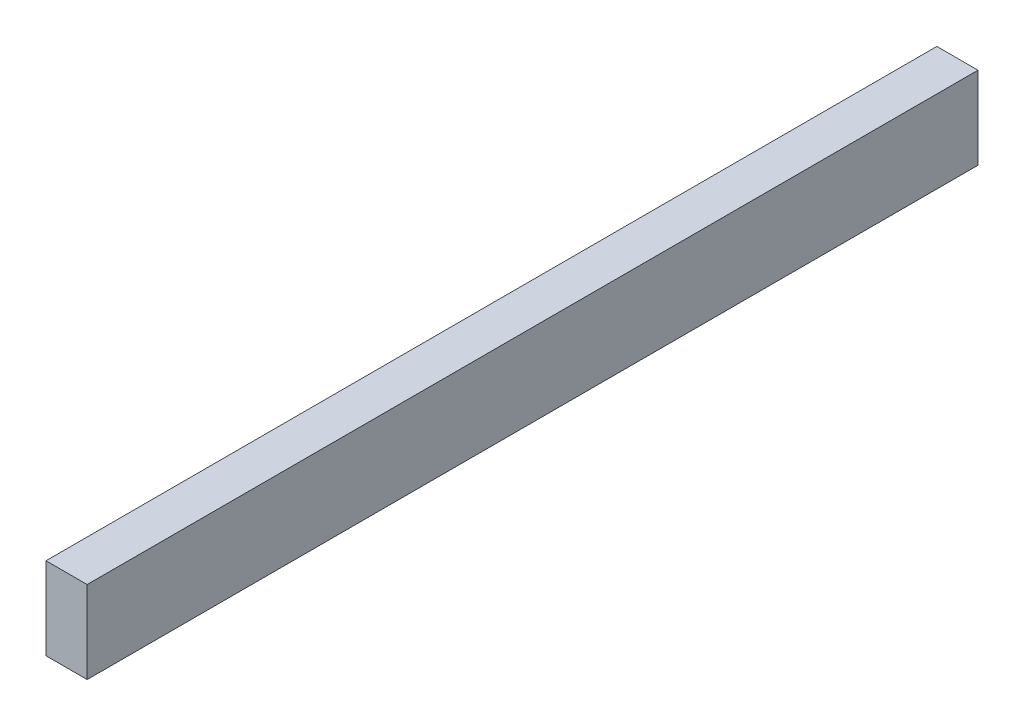
ISO-10303-21;
HEADER;
FILE_DESCRIPTION(('STEP AP214'),'2;1');
FILE_NAME('part.step','',(''),(''),'','','');
FILE_SCHEMA(('AUTOMOTIVE_DESIGN { 1 0 10303 214 1 1 1 1 }'));
ENDSEC;
DATA;
#1=APPLICATION_CONTEXT('core data for automotive mechanical design processes');
#2=APPLICATION_PROTOCOL_DEFINITION('international standard','automotive_design',2000,#1);
#3=PRODUCT_CONTEXT('',#1,'mechanical');
#4=PRODUCT('Part','Part','',(#3));
#5=PRODUCT_RELATED_PRODUCT_CATEGORY('part','',(#4));
#6=PRODUCT_DEFINITION_FORMATION('','',#4);
#7=PRODUCT_DEFINITION_CONTEXT('part definition',#1,'design');
#8=PRODUCT_DEFINITION('design','',#6,#7);
#9=PRODUCT_DEFINITION_SHAPE('','',#8);
#10=(LENGTH_UNIT() NAMED_UNIT(*) SI_UNIT(.MILLI.,.METRE.));
#11=(NAMED_UNIT(*) PLANE_ANGLE_UNIT() SI_UNIT($,.RADIAN.));
#12=(NAMED_UNIT(*) SI_UNIT($,.STERADIAN.) SOLID_ANGLE_UNIT());
#13=UNCERTAINTY_MEASURE_WITH_UNIT(LENGTH_MEASURE(1.E-05),#10,'distance_accuracy_value','');
#14=(GEOMETRIC_REPRESENTATION_CONTEXT(3) GLOBAL_UNCERTAINTY_ASSIGNED_CONTEXT((#13)) GLOBAL_UNIT_ASSIGNED_CONTEXT((#10,
#11,#12)) REPRESENTATION_CONTEXT('',''));
#15=CARTESIAN_POINT('',(0.,0.,0.));
#16=DIRECTION('',(0.,0.,1.));
#17=DIRECTION('',(1.,0.,0.));
#18=AXIS2_PLACEMENT_3D('',#15,#16,#17);
#19=CARTESIAN_POINT('',(19.05,-11.7187133333333,119.106808888889));
#20=DIRECTION('',(0.,0.,-1.));
#21=DIRECTION('',(0.,1.,0.));
#22=AXIS2_PLACEMENT_3D('',#19,#20,#21);
#23=PLANE('',#22);
#24=DIRECTION('',(0.,-1.,0.));
#25=VECTOR('',#24,1.);
#26=CARTESIAN_POINT('',(0.,-11.7187133333333,119.106808888889));
#27=LINE('',#26,#25);
#28=CARTESIAN_POINT('',(0.,-11.7187133333333,119.106808888889));
#29=VERTEX_POINT('',#28);
#30=CARTESIAN_POINT('',(0.,-49.8187133333333,119.106808888889));
#31=VERTEX_POINT('',#30);
#32=EDGE_CURVE('E107',#29,#31,#27,.T.);
#33=ORIENTED_EDGE('',*,*,#32,.T.);
#34=DIRECTION('',(-1.,0.,0.));
#35=VECTOR('',#34,1.);
#36=CARTESIAN_POINT('',(19.05,-49.8187133333333,119.106808888889));
#37=LINE('',#36,#35);
#38=CARTESIAN_POINT('',(19.05,-49.8187133333333,119.106808888889));
#39=VERTEX_POINT('',#38);
#40=EDGE_CURVE('E11',#39,#31,#37,.T.);
#41=ORIENTED_EDGE('',*,*,#40,.F.);
#42=DIRECTION('',(0.,-1.,0.));
#43=VECTOR('',#42,1.);
#44=CARTESIAN_POINT('',(19.05,-11.7187133333333,119.106808888889));
#45=LINE('',#44,#43);
#46=CARTESIAN_POINT('',(19.05,-11.7187133333333,119.106808888889));
#47=VERTEX_POINT('',#46);
#48=EDGE_CURVE('E91',#47,#39,#45,.T.);
#49=ORIENTED_EDGE('',*,*,#48,.F.);
#50=DIRECTION('',(-1.,0.,0.));
#51=VECTOR('',#50,1.);
#52=CARTESIAN_POINT('',(19.05,-11.7187133333333,119.106808888889));
#53=LINE('',#52,#51);
#54=EDGE_CURVE('E103',#47,#29,#53,.T.);
#55=ORIENTED_EDGE('',*,*,#54,.T.);
#56=EDGE_LOOP('',(#33,#41,#49,#55));
#57=FACE_BOUND('',#56,.T.);
#58=ADVANCED_FACE('F39',(#57),#23,.F.);
#59=CARTESIAN_POINT('',(19.05,-49.8187133333333,119.106808888889));
#60=DIRECTION('',(0.,1.,0.));
#61=DIRECTION('',(0.,0.,1.));
#62=AXIS2_PLACEMENT_3D('',#59,#60,#61);
#63=PLANE('',#62);
#64=DIRECTION('',(0.,0.,-1.));
#65=VECTOR('',#64,1.);
#66=CARTESIAN_POINT('',(0.,-49.8187133333333,119.106808888889));
#67=LINE('',#66,#65);
#68=CARTESIAN_POINT('',(0.,-49.8187133333333,-293.185991111111));
#69=VERTEX_POINT('',#68);
#70=EDGE_CURVE('E96',#31,#69,#67,.T.);
#71=ORIENTED_EDGE('',*,*,#70,.T.);
#72=DIRECTION('',(-1.,0.,0.));
#73=VECTOR('',#72,1.);
#74=CARTESIAN_POINT('',(19.05,-49.8187133333333,-293.185991111111));
#75=LINE('',#74,#73);
#76=CARTESIAN_POINT('',(19.05,-49.8187133333333,-293.185991111111));
#77=VERTEX_POINT('',#76);
#78=EDGE_CURVE('E48',#77,#69,#75,.T.);
#79=ORIENTED_EDGE('',*,*,#78,.F.);
#80=DIRECTION('',(0.,0.,-1.));
#81=VECTOR('',#80,1.);
#82=CARTESIAN_POINT('',(19.05,-49.8187133333333,119.106808888889));
#83=LINE('',#82,#81);
#84=EDGE_CURVE('E86',#39,#77,#83,.T.);
#85=ORIENTED_EDGE('',*,*,#84,.F.);
#86=ORIENTED_EDGE('',*,*,#40,.T.);
#87=EDGE_LOOP('',(#71,#79,#85,#86));
#88=FACE_BOUND('',#87,.T.);
#89=ADVANCED_FACE('F95',(#88),#63,.F.);
#90=CARTESIAN_POINT('',(19.05,-11.7187133333333,-293.185991111111));
#91=DIRECTION('',(0.,0.,1.));
#92=DIRECTION('',(1.,0.,0.));
#93=AXIS2_PLACEMENT_3D('',#90,#91,#92);
#94=PLANE('',#93);
#95=DIRECTION('',(0.,1.,0.));
#96=VECTOR('',#95,1.);
#97=CARTESIAN_POINT('',(0.,-11.7187133333333,-293.185991111111));
#98=LINE('',#97,#96);
#99=CARTESIAN_POINT('',(0.,-11.7187133333333,-293.185991111111));
#100=VERTEX_POINT('',#99);
#101=EDGE_CURVE('E73',#69,#100,#98,.T.);
#102=ORIENTED_EDGE('',*,*,#101,.T.);
#103=DIRECTION('',(-1.,0.,0.));
#104=VECTOR('',#103,1.);
#105=CARTESIAN_POINT('',(19.05,-11.7187133333333,-293.185991111111));
#106=LINE('',#105,#104);
#107=CARTESIAN_POINT('',(19.05,-11.7187133333333,-293.185991111111));
#108=VERTEX_POINT('',#107);
#109=EDGE_CURVE('E98',#108,#100,#106,.T.);
#110=ORIENTED_EDGE('',*,*,#109,.F.);
#111=DIRECTION('',(0.,1.,0.));
#112=VECTOR('',#111,1.);
#113=CARTESIAN_POINT('',(19.05,-11.7187133333333,-293.185991111111));
#114=LINE('',#113,#112);
#115=EDGE_CURVE('E89',#77,#108,#114,.T.);
#116=ORIENTED_EDGE('',*,*,#115,.F.);
#117=ORIENTED_EDGE('',*,*,#78,.T.);
#118=EDGE_LOOP('',(#102,#110,#116,#117));
#119=FACE_BOUND('',#118,.T.);
#120=ADVANCED_FACE('F99',(#119),#94,.F.);
#121=CARTESIAN_POINT('',(19.05,-11.7187133333333,119.106808888889));
#122=DIRECTION('',(0.,-1.,0.));
#123=DIRECTION('',(0.,0.,-1.));
#124=AXIS2_PLACEMENT_3D('',#121,#122,#123);
#125=PLANE('',#124);
#126=DIRECTION('',(0.,0.,1.));
#127=VECTOR('',#126,1.);
#128=CARTESIAN_POINT('',(0.,-11.7187133333333,119.106808888889));
#129=LINE('',#128,#127);
#130=EDGE_CURVE('E79',#100,#29,#129,.T.);
#131=ORIENTED_EDGE('',*,*,#130,.T.);
#132=ORIENTED_EDGE('',*,*,#54,.F.);
#133=DIRECTION('',(0.,0.,1.));
#134=VECTOR('',#133,1.);
#135=CARTESIAN_POINT('',(19.05,-11.7187133333333,119.106808888889));
#136=LINE('',#135,#134);
#137=EDGE_CURVE('E56',#108,#47,#136,.T.);
#138=ORIENTED_EDGE('',*,*,#137,.F.);
#139=ORIENTED_EDGE('',*,*,#109,.T.);
#140=EDGE_LOOP('',(#131,#132,#138,#139));
#141=FACE_BOUND('',#140,.T.);
#142=ADVANCED_FACE('F120',(#141),#125,.F.);
#143=CARTESIAN_POINT('',(19.05,0.,0.));
#144=DIRECTION('',(1.,0.,0.));
#145=DIRECTION('',(0.,0.,-1.));
#146=AXIS2_PLACEMENT_3D('',#143,#144,#145);
#147=PLANE('',#146);
#148=ORIENTED_EDGE('',*,*,#48,.T.);
#149=ORIENTED_EDGE('',*,*,#84,.T.);
#150=ORIENTED_EDGE('',*,*,#115,.T.);
#151=ORIENTED_EDGE('',*,*,#137,.T.);
#152=EDGE_LOOP('',(#148,#149,#150,#151));
#153=FACE_BOUND('',#152,.T.);
#154=ADVANCED_FACE('F87',(#153),#147,.T.);
#155=CARTESIAN_POINT('',(0.,0.,0.));
#156=DIRECTION('',(1.,0.,0.));
#157=DIRECTION('',(0.,0.,-1.));
#158=AXIS2_PLACEMENT_3D('',#155,#156,#157);
#159=PLANE('',#158);
#160=ORIENTED_EDGE('',*,*,#32,.F.);
#161=ORIENTED_EDGE('',*,*,#130,.F.);
#162=ORIENTED_EDGE('',*,*,#101,.F.);
#163=ORIENTED_EDGE('',*,*,#70,.F.);
#164=EDGE_LOOP('',(#160,#161,#162,#163));
#165=FACE_BOUND('',#164,.T.);
#166=ADVANCED_FACE('F123',(#165),#159,.F.);
#167=CLOSED_SHELL('',(#58,#89,#120,#142,#154,#166));
#168=MANIFOLD_SOLID_BREP('B2',#167);
#169=ADVANCED_BREP_SHAPE_REPRESENTATION('',(#18,#168),#14);
#170=SHAPE_DEFINITION_REPRESENTATION(#9,#169);
ENDSEC;
END-ISO-10303-21;
